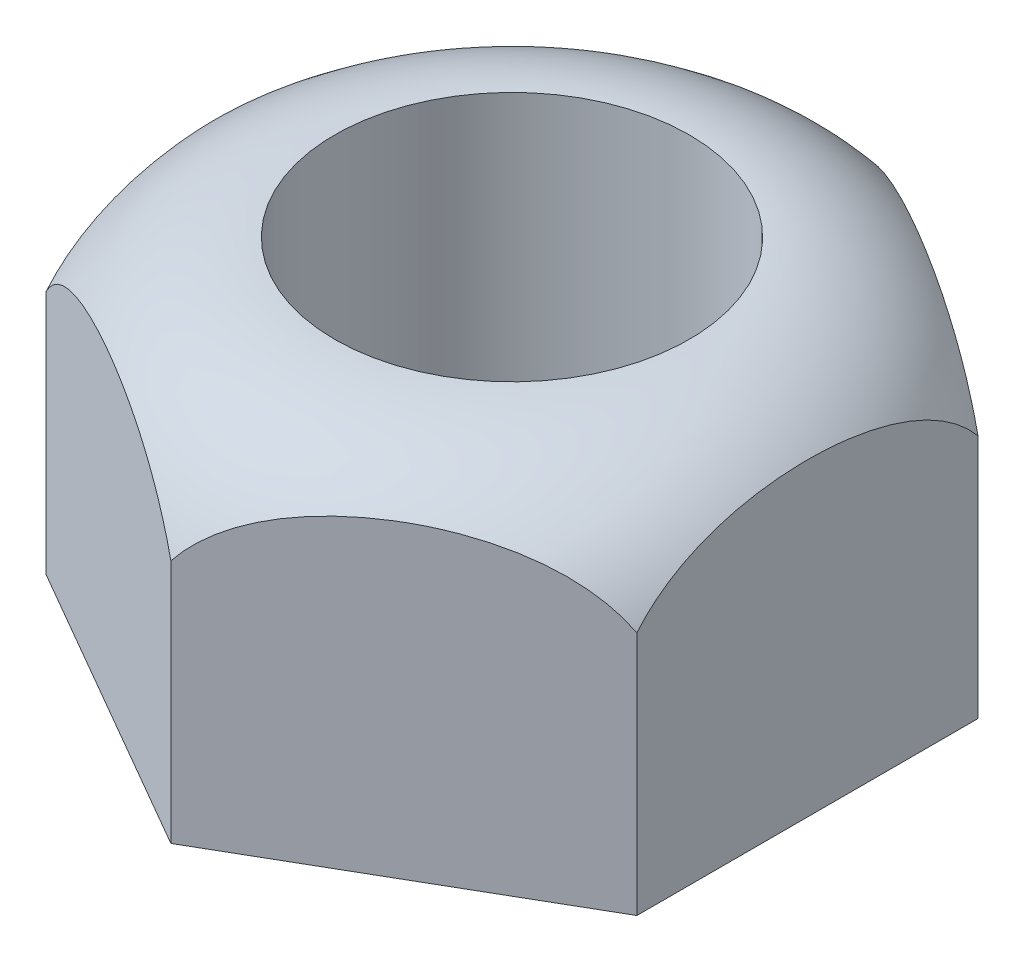
ISO-10303-21;
HEADER;
FILE_DESCRIPTION(('STEP AP214'),'2;1');
FILE_NAME('part.step','',(''),(''),'','','');
FILE_SCHEMA(('AUTOMOTIVE_DESIGN { 1 0 10303 214 1 1 1 1 }'));
ENDSEC;
DATA;
#1=APPLICATION_CONTEXT('core data for automotive mechanical design processes');
#2=APPLICATION_PROTOCOL_DEFINITION('international standard','automotive_design',2000,#1);
#3=PRODUCT_CONTEXT('',#1,'mechanical');
#4=PRODUCT('Part','Part','',(#3));
#5=PRODUCT_RELATED_PRODUCT_CATEGORY('part','',(#4));
#6=PRODUCT_DEFINITION_FORMATION('','',#4);
#7=PRODUCT_DEFINITION_CONTEXT('part definition',#1,'design');
#8=PRODUCT_DEFINITION('design','',#6,#7);
#9=PRODUCT_DEFINITION_SHAPE('','',#8);
#10=(LENGTH_UNIT() NAMED_UNIT(*) SI_UNIT(.MILLI.,.METRE.));
#11=(NAMED_UNIT(*) PLANE_ANGLE_UNIT() SI_UNIT($,.RADIAN.));
#12=(NAMED_UNIT(*) SI_UNIT($,.STERADIAN.) SOLID_ANGLE_UNIT());
#13=UNCERTAINTY_MEASURE_WITH_UNIT(LENGTH_MEASURE(1.E-05),#10,'distance_accuracy_value','');
#14=(GEOMETRIC_REPRESENTATION_CONTEXT(3) GLOBAL_UNCERTAINTY_ASSIGNED_CONTEXT((#13)) GLOBAL_UNIT_ASSIGNED_CONTEXT((#10,
#11,#12)) REPRESENTATION_CONTEXT('',''));
#15=CARTESIAN_POINT('',(0.,0.,0.));
#16=DIRECTION('',(0.,0.,1.));
#17=DIRECTION('',(1.,0.,0.));
#18=AXIS2_PLACEMENT_3D('',#15,#16,#17);
#19=CARTESIAN_POINT('',(0.,-3.,0.));
#20=DIRECTION('',(0.,1.,0.));
#21=DIRECTION('',(0.,0.,1.));
#22=AXIS2_PLACEMENT_3D('',#19,#20,#21);
#23=PLANE('',#22);
#24=DIRECTION('',(0.,0.,-1.));
#25=VECTOR('',#24,1.);
#26=CARTESIAN_POINT('',(4.99999999999999,-3.,2.88675134594813));
#27=LINE('',#26,#25);
#28=CARTESIAN_POINT('',(4.99999999999999,-3.,2.88675134594813));
#29=VERTEX_POINT('',#28);
#30=CARTESIAN_POINT('',(4.99999999999999,-3.,-2.88675134594813));
#31=VERTEX_POINT('',#30);
#32=EDGE_CURVE('E127',#29,#31,#27,.T.);
#33=ORIENTED_EDGE('',*,*,#32,.F.);
#34=DIRECTION('',(0.866025403784439,0.,-0.5));
#35=VECTOR('',#34,1.);
#36=CARTESIAN_POINT('',(0.,-3.,5.77350269189626));
#37=LINE('',#36,#35);
#38=CARTESIAN_POINT('',(0.,-3.,5.77350269189626));
#39=VERTEX_POINT('',#38);
#40=EDGE_CURVE('E116',#39,#29,#37,.T.);
#41=ORIENTED_EDGE('',*,*,#40,.F.);
#42=DIRECTION('',(0.866025403784439,0.,0.5));
#43=VECTOR('',#42,1.);
#44=CARTESIAN_POINT('',(-5.,-3.,2.88675134594813));
#45=LINE('',#44,#43);
#46=CARTESIAN_POINT('',(-5.,-3.,2.88675134594813));
#47=VERTEX_POINT('',#46);
#48=EDGE_CURVE('E118',#47,#39,#45,.T.);
#49=ORIENTED_EDGE('',*,*,#48,.F.);
#50=DIRECTION('',(0.,0.,1.));
#51=VECTOR('',#50,1.);
#52=CARTESIAN_POINT('',(-5.,-3.,-2.88675134594813));
#53=LINE('',#52,#51);
#54=CARTESIAN_POINT('',(-5.,-3.,-2.88675134594813));
#55=VERTEX_POINT('',#54);
#56=EDGE_CURVE('E121',#55,#47,#53,.T.);
#57=ORIENTED_EDGE('',*,*,#56,.F.);
#58=DIRECTION('',(-0.866025403784439,0.,0.5));
#59=VECTOR('',#58,1.);
#60=CARTESIAN_POINT('',(0.,-3.,-5.77350269189626));
#61=LINE('',#60,#59);
#62=CARTESIAN_POINT('',(0.,-3.,-5.77350269189626));
#63=VERTEX_POINT('',#62);
#64=EDGE_CURVE('E124',#63,#55,#61,.T.);
#65=ORIENTED_EDGE('',*,*,#64,.F.);
#66=DIRECTION('',(-0.866025403784439,0.,-0.5));
#67=VECTOR('',#66,1.);
#68=CARTESIAN_POINT('',(4.99999999999999,-3.,-2.88675134594813));
#69=LINE('',#68,#67);
#70=EDGE_CURVE('E107',#31,#63,#69,.T.);
#71=ORIENTED_EDGE('',*,*,#70,.F.);
#72=EDGE_LOOP('',(#33,#41,#49,#57,#65,#71));
#73=FACE_BOUND('',#72,.T.);
#74=CARTESIAN_POINT('',(0.,-3.,0.));
#75=DIRECTION('',(0.,1.,0.));
#76=DIRECTION('',(0.,0.,1.));
#77=AXIS2_PLACEMENT_3D('',#74,#75,#76);
#78=CIRCLE('',#77,3.);
#79=CARTESIAN_POINT('',(0.,-3.,3.));
#80=VERTEX_POINT('',#79);
#81=EDGE_CURVE('E129',#80,#80,#78,.T.);
#82=ORIENTED_EDGE('',*,*,#81,.T.);
#83=EDGE_LOOP('',(#82));
#84=FACE_BOUND('',#83,.T.);
#85=ADVANCED_FACE('F34',(#73,#84),#23,.F.);
#86=CARTESIAN_POINT('',(4.99999999999999,3.,2.88675134594813));
#87=DIRECTION('',(-1.,0.,0.));
#88=DIRECTION('',(0.,0.,1.));
#89=AXIS2_PLACEMENT_3D('',#86,#87,#88);
#90=PLANE('',#89);
#91=DIRECTION('',(0.,-1.,0.));
#92=VECTOR('',#91,1.);
#93=CARTESIAN_POINT('',(4.99999999999999,3.,-2.88675134594813));
#94=LINE('',#93,#92);
#95=CARTESIAN_POINT('',(5.,1.14353960055794,-2.88675134594813));
#96=VERTEX_POINT('',#95);
#97=EDGE_CURVE('E11',#96,#31,#94,.T.);
#98=ORIENTED_EDGE('',*,*,#97,.F.);
#99=CARTESIAN_POINT('',(4.99999999999999,2.23606797749979,0.));
#100=CARTESIAN_POINT('',(4.99999999999999,2.23606547708485,0.120918907635913));
#101=CARTESIAN_POINT('',(4.99999999999999,2.23215695883544,0.241827848779719));
#102=CARTESIAN_POINT('',(4.99999999999999,2.21636735639039,0.483117337858945));
#103=CARTESIAN_POINT('',(4.99999999999999,2.20448748147199,0.603497963153676));
#104=CARTESIAN_POINT('',(4.99999999999999,2.17230957672205,0.843175170668359));
#105=CARTESIAN_POINT('',(4.99999999999999,2.15200965486483,0.962471503081574));
#106=CARTESIAN_POINT('',(4.99999999999999,2.10228318635368,1.19911813128936));
#107=CARTESIAN_POINT('',(4.99999999999999,2.07285946731982,1.31646901815666));
#108=CARTESIAN_POINT('',(4.99999999999999,1.99149257912571,1.59010251201208));
#109=CARTESIAN_POINT('',(4.99999999999999,1.93525457949775,1.74515200180723));
#110=CARTESIAN_POINT('',(4.99999999999999,1.80136991737628,2.04572548254269));
#111=CARTESIAN_POINT('',(4.99999999999999,1.72375539118573,2.19126336952084));
#112=CARTESIAN_POINT('',(4.99999999999999,1.56277118376517,2.43890308689245));
#113=CARTESIAN_POINT('',(4.99999999999999,1.48377397538791,2.54382254430582));
#114=CARTESIAN_POINT('',(4.99999999999999,1.30987699827946,2.7396282799976));
#115=CARTESIAN_POINT('',(4.99999999999999,1.21499717596204,2.83053188858002));
#116=CARTESIAN_POINT('',(4.99999999999999,1.0301159573075,2.97723052563607));
#117=CARTESIAN_POINT('',(4.99999999999999,0.942813107119015,3.0364145149125));
#118=CARTESIAN_POINT('',(4.99999999999999,0.759583936212259,3.13957828549396));
#119=CARTESIAN_POINT('',(4.99999999999999,0.663661656029086,3.18356514439735));
#120=CARTESIAN_POINT('',(4.99999999999999,0.464847484174504,3.25393965352395));
#121=CARTESIAN_POINT('',(4.99999999999999,0.361917437478582,3.28022077701964));
#122=CARTESIAN_POINT('',(4.99999999999999,0.15294111182827,3.31290834387848));
#123=CARTESIAN_POINT('',(4.99999999999999,0.0468962069976227,3.31932342209303));
#124=CARTESIAN_POINT('',(4.99999999999999,-0.153734080318637,3.31222176535418));
#125=CARTESIAN_POINT('',(4.99999999999999,-0.248394487684605,3.30065386765089));
#126=CARTESIAN_POINT('',(4.99999999999999,-0.434404619303879,3.26181910522999));
#127=CARTESIAN_POINT('',(4.99999999999999,-0.525754653885907,3.23455371613119));
#128=CARTESIAN_POINT('',(4.99999999999999,-0.703233395942723,3.16568011577716));
#129=CARTESIAN_POINT('',(4.99999999999999,-0.789340379448156,3.12401645042847));
#130=CARTESIAN_POINT('',(4.99999999999999,-0.954375501924881,3.02836892053913));
#131=CARTESIAN_POINT('',(4.99999999999999,-1.03330025498121,2.97437928682587));
#132=CARTESIAN_POINT('',(4.99999999999999,-1.21217999234046,2.83319578618356));
#133=CARTESIAN_POINT('',(4.99999999999999,-1.30839251775865,2.74125094122274));
#134=CARTESIAN_POINT('',(4.99999999999999,-1.48457457681218,2.54296994059313));
#135=CARTESIAN_POINT('',(4.99999999999999,-1.5645150618035,2.43660860279747));
#136=CARTESIAN_POINT('',(4.99999999999999,-1.73831292997454,2.16830650460945));
#137=CARTESIAN_POINT('',(4.99999999999999,-1.82449575152687,2.0014223589474));
#138=CARTESIAN_POINT('',(4.99999999999999,-1.96979428306982,1.65626349949258));
#139=CARTESIAN_POINT('',(4.99999999999999,-2.0288469548393,1.47796334338487));
#140=CARTESIAN_POINT('',(4.99999999999999,-2.11230706123924,1.15914275681445));
#141=CARTESIAN_POINT('',(4.99999999999999,-2.14163215600666,1.01985771960752));
#142=CARTESIAN_POINT('',(4.99999999999999,-2.18827639288221,0.739223942062745));
#143=CARTESIAN_POINT('',(4.99999999999999,-2.20558839332926,0.597874025064965));
#144=CARTESIAN_POINT('',(4.99999999999999,-2.22908563764715,0.314037780514991));
#145=CARTESIAN_POINT('',(4.99999999999999,-2.2352521116048,0.171549941078096));
#146=CARTESIAN_POINT('',(4.99999999999999,-2.23673283017761,-0.113440619086964));
#147=CARTESIAN_POINT('',(4.99999999999999,-2.23205071801853,-0.255943318753454));
#148=CARTESIAN_POINT('',(4.99999999999999,-2.21317816931042,-0.518018786832451));
#149=CARTESIAN_POINT('',(4.99999999999999,-2.20058157063548,-0.637707348758131));
#150=CARTESIAN_POINT('',(4.99999999999999,-2.16699996802981,-0.875936112436773));
#151=CARTESIAN_POINT('',(4.99999999999999,-2.14601392442707,-0.994476169994405));
#152=CARTESIAN_POINT('',(4.99999999999999,-2.09500227924768,-1.22924960329497));
#153=CARTESIAN_POINT('',(4.99999999999999,-2.06500417832384,-1.34548886578246));
#154=CARTESIAN_POINT('',(4.99999999999999,-1.99503238840018,-1.57487815676775));
#155=CARTESIAN_POINT('',(4.99999999999999,-1.95506445754837,-1.68802992676516));
#156=CARTESIAN_POINT('',(4.99999999999999,-1.85282705434588,-1.93726711187123));
#157=CARTESIAN_POINT('',(4.99999999999999,-1.78748843719083,-2.07212579721777));
#158=CARTESIAN_POINT('',(4.99999999999999,-1.63755093552136,-2.3307739159673));
#159=CARTESIAN_POINT('',(4.99999999999999,-1.55297200147192,-2.45457463159287));
#160=CARTESIAN_POINT('',(4.99999999999999,-1.38203242292518,-2.66253632811602));
#161=CARTESIAN_POINT('',(4.99999999999999,-1.2993405858539,-2.7496924410226));
#162=CARTESIAN_POINT('',(4.99999999999999,-1.12084494282723,-2.909419315686));
#163=CARTESIAN_POINT('',(4.99999999999999,-1.02505637822909,-2.98200679289585));
#164=CARTESIAN_POINT('',(4.99999999999999,-0.838185476698753,-3.0982354091423));
#165=CARTESIAN_POINT('',(4.99999999999999,-0.748838484702114,-3.14465751090598));
#166=CARTESIAN_POINT('',(4.99999999999999,-0.563617831829161,-3.22195881654211));
#167=CARTESIAN_POINT('',(4.99999999999999,-0.467746985968321,-3.25284467656011));
#168=CARTESIAN_POINT('',(4.99999999999999,-0.271626556165446,-3.29731276667061));
#169=CARTESIAN_POINT('',(4.99999999999999,-0.171360951813679,-3.31082509659772));
#170=CARTESIAN_POINT('',(4.99999999999999,0.0299567601643019,-3.31940920815924));
#171=CARTESIAN_POINT('',(4.99999999999999,0.131008734859816,-3.31448404174156));
#172=CARTESIAN_POINT('',(4.99999999999999,0.323626511314792,-3.28751634425651));
#173=CARTESIAN_POINT('',(4.99999999999999,0.415365206264283,-3.26668052657209));
#174=CARTESIAN_POINT('',(4.99999999999999,0.594254757868503,-3.21051142143265));
#175=CARTESIAN_POINT('',(4.99999999999999,0.681405348220315,-3.17517729351067));
#176=CARTESIAN_POINT('',(4.99999999999999,0.852902766659784,-3.08996682861327));
#177=CARTESIAN_POINT('',(4.99999999999999,0.936971260358956,-3.0395342866492));
#178=CARTESIAN_POINT('',(4.99999999999999,1.09690441917607,-2.92708168680618));
#179=CARTESIAN_POINT('',(4.99999999999999,1.1727653643736,-2.86505640918113));
#180=CARTESIAN_POINT('',(4.99999999999999,1.34862628219194,-2.70091379330323));
#181=CARTESIAN_POINT('',(4.99999999999999,1.44367677918478,-2.59347912144342));
#182=CARTESIAN_POINT('',(4.99999999999999,1.61523047085954,-2.3646875635332));
#183=CARTESIAN_POINT('',(4.99999999999999,1.69168854122065,-2.2432978383347));
#184=CARTESIAN_POINT('',(4.99999999999999,1.85813802690555,-1.93419060871512));
#185=CARTESIAN_POINT('',(4.99999999999999,1.93857989311894,-1.74132926635834));
#186=CARTESIAN_POINT('',(4.99999999999999,2.03604362805079,-1.44490972333349));
#187=CARTESIAN_POINT('',(4.99999999999999,2.06468018171814,-1.3448228636016));
#188=CARTESIAN_POINT('',(4.99999999999999,2.11488760022331,-1.14288449210295));
#189=CARTESIAN_POINT('',(4.99999999999999,2.13645992156809,-1.04103334866254));
#190=CARTESIAN_POINT('',(4.99999999999999,2.18243116291176,-0.783859414389841));
#191=CARTESIAN_POINT('',(4.99999999999999,2.20264847587348,-0.627789688123208));
#192=CARTESIAN_POINT('',(4.99999999999999,2.22947043045928,-0.314474570572886));
#193=CARTESIAN_POINT('',(4.99999999999999,2.23607122874808,-0.157228859927116));
#194=CARTESIAN_POINT('',(4.99999999999999,2.23606797749979,0.));
#195=B_SPLINE_CURVE_WITH_KNOTS('',3,(#99,#100,#101,#102,#103,#104,#105,#106,#107,#108,#109,#110,
#111,#112,#113,#114,#115,#116,#117,#118,#119,#120,#121,#122,#123,#124,#125,#126,#127,#128,#129,
#130,#131,#132,#133,#134,#135,#136,#137,#138,#139,#140,#141,#142,#143,#144,#145,#146,#147,#148,
#149,#150,#151,#152,#153,#154,#155,#156,#157,#158,#159,#160,#161,#162,#163,#164,#165,#166,#167,
#168,#169,#170,#171,#172,#173,#174,#175,#176,#177,#178,#179,#180,#181,#182,#183,#184,#185,#186,
#187,#188,#189,#190,#191,#192,#193,#194),.UNSPECIFIED.,.T.,.F.,(4,2,2,2,2,2,2,2,2,2,2,2,2,2,2,2,
2,2,2,2,2,2,2,2,2,2,2,2,2,2,2,2,2,2,2,2,2,2,2,2,2,2,2,2,2,2,2,4),(0.,0.362673965901397,
0.72529292557616,1.08799341168277,1.45058160289177,1.94401806167096,2.43671672640692,
2.82932144264359,3.22143674955952,3.53657847104138,3.8515732264426,4.16844661865274,
4.48518226130435,4.76990781469742,5.05460660726683,5.34041435089636,5.6263561421647,
6.02338925123516,6.42112504006141,6.98148877350558,7.54314803489807,7.96962891026468,
8.39636310741747,8.8238152901349,9.25112394455638,9.611905094895,9.97273096933659,
10.3324667643941,10.6919952705368,11.1401969679133,11.5879360221887,11.9470202530772,
12.3056901001392,12.6064755350347,12.9071319953369,13.2089943614697,13.5108067627123,
13.791757368672,14.072724263638,14.3656805716756,14.6587691054092,15.0866864035578,
15.5156321286721,16.1388153709031,16.4509640992346,16.7630484280037,17.2344943502383,
17.7060733224502),.UNSPECIFIED.);
#196=CARTESIAN_POINT('',(5.,1.14353960055794,2.88675134594813));
#197=VERTEX_POINT('',#196);
#198=EDGE_CURVE('E92',#96,#197,#195,.T.);
#199=ORIENTED_EDGE('',*,*,#198,.T.);
#200=DIRECTION('',(0.,-1.,0.));
#201=VECTOR('',#200,1.);
#202=CARTESIAN_POINT('',(4.99999999999999,3.,2.88675134594813));
#203=LINE('',#202,#201);
#204=EDGE_CURVE('E58',#197,#29,#203,.T.);
#205=ORIENTED_EDGE('',*,*,#204,.T.);
#206=ORIENTED_EDGE('',*,*,#32,.T.);
#207=EDGE_LOOP('',(#98,#199,#205,#206));
#208=FACE_BOUND('',#207,.T.);
#209=ADVANCED_FACE('F36',(#208),#90,.F.);
#210=CARTESIAN_POINT('',(4.99999999999999,3.,-2.88675134594813));
#211=DIRECTION('',(-0.5,0.,0.866025403784439));
#212=DIRECTION('',(0.866025403784439,0.,0.5));
#213=AXIS2_PLACEMENT_3D('',#210,#211,#212);
#214=PLANE('',#213);
#215=DIRECTION('',(0.,-1.,0.));
#216=VECTOR('',#215,1.);
#217=CARTESIAN_POINT('',(0.,3.,-5.77350269189626));
#218=LINE('',#217,#216);
#219=CARTESIAN_POINT('',(0.,1.14353960055794,-5.77350269189626));
#220=VERTEX_POINT('',#219);
#221=EDGE_CURVE('E43',#220,#63,#218,.T.);
#222=ORIENTED_EDGE('',*,*,#221,.F.);
#223=CARTESIAN_POINT('',(-0.000142810290228146,1.14333960055794,-5.77358514345576));
#224=CARTESIAN_POINT('',(0.0893124367608543,1.26853746801625,-5.72193813249039));
#225=CARTESIAN_POINT('',(0.190281036219496,1.38106208917785,-5.66364388441325));
#226=CARTESIAN_POINT('',(0.407192690678229,1.58081776284459,-5.53840988232113));
#227=CARTESIAN_POINT('',(0.522887072573814,1.66840452885689,-5.47161369978999));
#228=CARTESIAN_POINT('',(0.800973119005675,1.8453618653456,-5.31106064602468));
#229=CARTESIAN_POINT('',(0.966868613847032,1.92718000731215,-5.21528083742067));
#230=CARTESIAN_POINT('',(1.30867200266892,2.06044665989698,-5.01794055887443));
#231=CARTESIAN_POINT('',(1.48464915509275,2.11164793833912,-4.91634010255131));
#232=CARTESIAN_POINT('',(1.79145018682874,2.17711091081525,-4.73920844429088));
#233=CARTESIAN_POINT('',(1.92132792676049,2.19766815653355,-4.66422349617955));
#234=CARTESIAN_POINT('',(2.18219334190964,2.22609275762975,-4.51361277852092));
#235=CARTESIAN_POINT('',(2.31318159389259,2.23395305381997,-4.43798667597788));
#236=CARTESIAN_POINT('',(2.57506109966329,2.23743805351204,-4.28679047282592));
#237=CARTESIAN_POINT('',(2.70595216180202,2.23308274414345,-4.21122048286561));
#238=CARTESIAN_POINT('',(2.96690448797829,2.21191397733964,-4.06055958710208));
#239=CARTESIAN_POINT('',(3.09696617716107,2.19510752531275,-3.98546843584115));
#240=CARTESIAN_POINT('',(3.40008780053761,2.13995147605242,-3.8104610849875));
#241=CARTESIAN_POINT('',(3.57244496899929,2.09615790937785,-3.71095062737939));
#242=CARTESIAN_POINT('',(3.9098954373457,1.98015119492548,-3.51612350864143));
#243=CARTESIAN_POINT('',(4.07500016298977,1.90798467322086,-3.42080025084634));
#244=CARTESIAN_POINT('',(4.34810663584005,1.75430816427858,-3.2631221552288));
#245=CARTESIAN_POINT('',(4.45941552985277,1.68069324538259,-3.19885793530736));
#246=CARTESIAN_POINT('',(4.6702948231368,1.51399060964207,-3.07710671856331));
#247=CARTESIAN_POINT('',(4.7699080013148,1.42097754781097,-3.01959502332741));
#248=CARTESIAN_POINT('',(4.90999536744939,1.26268968281893,-2.93871554477953));
#249=CARTESIAN_POINT('',(4.95652867353715,1.20445511317756,-2.91184952798348));
#250=CARTESIAN_POINT('',(5.00014281029023,1.14333960055794,-2.88666889438862));
#251=B_SPLINE_CURVE_WITH_KNOTS('',3,(#223,#224,#225,#226,#227,#228,#229,#230,#231,#232,#233,
#234,#235,#236,#237,#238,#239,#240,#241,#242,#243,#244,#245,#246,#247,#248,#249,#250),
.UNSPECIFIED.,.F.,.F.,(4,2,2,2,2,2,2,2,2,2,2,2,2,4),(0.,0.483993268461521,0.960690674025162,
1.58230674436584,2.20887687993225,2.66247501095778,3.1163252445534,3.56943332344352,
4.02228666275751,4.63192059230963,5.24055685286809,5.68346282766207,6.12469470637231,
6.36206056069102),.UNSPECIFIED.);
#252=EDGE_CURVE('E87',#220,#96,#251,.T.);
#253=ORIENTED_EDGE('',*,*,#252,.T.);
#254=ORIENTED_EDGE('',*,*,#97,.T.);
#255=ORIENTED_EDGE('',*,*,#70,.T.);
#256=EDGE_LOOP('',(#222,#253,#254,#255));
#257=FACE_BOUND('',#256,.T.);
#258=ADVANCED_FACE('F105',(#257),#214,.F.);
#259=CARTESIAN_POINT('',(0.,3.,-5.77350269189626));
#260=DIRECTION('',(0.5,0.,0.866025403784438));
#261=DIRECTION('',(0.866025403784439,0.,-0.5));
#262=AXIS2_PLACEMENT_3D('',#259,#260,#261);
#263=PLANE('',#262);
#264=DIRECTION('',(0.,-1.,0.));
#265=VECTOR('',#264,1.);
#266=CARTESIAN_POINT('',(-5.,3.,-2.88675134594813));
#267=LINE('',#266,#265);
#268=CARTESIAN_POINT('',(-5.,1.14353960055794,-2.88675134594813));
#269=VERTEX_POINT('',#268);
#270=EDGE_CURVE('E102',#269,#55,#267,.T.);
#271=ORIENTED_EDGE('',*,*,#270,.F.);
#272=CARTESIAN_POINT('',(-5.00014281029022,1.14333960055794,-2.88666889438863));
#273=CARTESIAN_POINT('',(-4.91068756323914,1.26853746801625,-2.93831590535399));
#274=CARTESIAN_POINT('',(-4.8097189637805,1.38106208917785,-2.99661015343114));
#275=CARTESIAN_POINT('',(-4.59280730932177,1.58081776284459,-3.12184415552326));
#276=CARTESIAN_POINT('',(-4.47711292742618,1.66840452885689,-3.1886403380544));
#277=CARTESIAN_POINT('',(-4.19902688099432,1.8453618653456,-3.34919339181971));
#278=CARTESIAN_POINT('',(-4.03313138615296,1.92718000731214,-3.44497320042372));
#279=CARTESIAN_POINT('',(-3.69132799733107,2.06044665989698,-3.64231347896996));
#280=CARTESIAN_POINT('',(-3.51535084490724,2.11164793833912,-3.74391393529309));
#281=CARTESIAN_POINT('',(-3.20854981317126,2.17711091081525,-3.92104559355351));
#282=CARTESIAN_POINT('',(-3.07867207323951,2.19766815653355,-3.99603054166485));
#283=CARTESIAN_POINT('',(-2.81780665809036,2.22609275762975,-4.14664125932347));
#284=CARTESIAN_POINT('',(-2.68681840610741,2.23395305381997,-4.22226736186651));
#285=CARTESIAN_POINT('',(-2.42493890033671,2.23743805351204,-4.37346356501847));
#286=CARTESIAN_POINT('',(-2.29404783819798,2.23308274414345,-4.44903355497878));
#287=CARTESIAN_POINT('',(-2.03309551202171,2.21191397733964,-4.59969445074231));
#288=CARTESIAN_POINT('',(-1.90303382283893,2.19510752531275,-4.67478560200324));
#289=CARTESIAN_POINT('',(-1.59991219946238,2.13995147605242,-4.84979295285689));
#290=CARTESIAN_POINT('',(-1.4275550310007,2.09615790937785,-4.949303410465));
#291=CARTESIAN_POINT('',(-1.0901045626543,1.98015119492548,-5.14413052920296));
#292=CARTESIAN_POINT('',(-0.924999837010228,1.90798467322086,-5.23945378699805));
#293=CARTESIAN_POINT('',(-0.651893364159947,1.75430816427858,-5.39713188261558));
#294=CARTESIAN_POINT('',(-0.540584470147226,1.68069324538258,-5.46139610253703));
#295=CARTESIAN_POINT('',(-0.329705176863198,1.51399060964207,-5.58314731928108));
#296=CARTESIAN_POINT('',(-0.230091998685199,1.42097754781097,-5.64065901451698));
#297=CARTESIAN_POINT('',(-0.0900046325506105,1.26268968281893,-5.72153849306485));
#298=CARTESIAN_POINT('',(-0.0434713264628498,1.20445511317756,-5.7484045098609));
#299=CARTESIAN_POINT('',(0.000142810290220696,1.14333960055794,-5.77358514345576));
#300=B_SPLINE_CURVE_WITH_KNOTS('',3,(#272,#273,#274,#275,#276,#277,#278,#279,#280,#281,#282,
#283,#284,#285,#286,#287,#288,#289,#290,#291,#292,#293,#294,#295,#296,#297,#298,#299),
.UNSPECIFIED.,.F.,.F.,(4,2,2,2,2,2,2,2,2,2,2,2,2,4),(0.,0.48399326846152,0.960690674025162,
1.58230674436584,2.20887687993225,2.66247501095778,3.1163252445534,3.56943332344352,
4.02228666275751,4.63192059230963,5.24055685286808,5.68346282766206,6.1246947063723,
6.36206056069101),.UNSPECIFIED.);
#301=EDGE_CURVE('E90',#269,#220,#300,.T.);
#302=ORIENTED_EDGE('',*,*,#301,.T.);
#303=ORIENTED_EDGE('',*,*,#221,.T.);
#304=ORIENTED_EDGE('',*,*,#64,.T.);
#305=EDGE_LOOP('',(#271,#302,#303,#304));
#306=FACE_BOUND('',#305,.T.);
#307=ADVANCED_FACE('F99',(#306),#263,.F.);
#308=CARTESIAN_POINT('',(-5.,3.,-2.88675134594813));
#309=DIRECTION('',(1.,0.,0.));
#310=DIRECTION('',(0.,0.,-1.));
#311=AXIS2_PLACEMENT_3D('',#308,#309,#310);
#312=PLANE('',#311);
#313=DIRECTION('',(0.,-1.,0.));
#314=VECTOR('',#313,1.);
#315=CARTESIAN_POINT('',(-5.,3.,2.88675134594813));
#316=LINE('',#315,#314);
#317=CARTESIAN_POINT('',(-5.,1.14353960055794,2.88675134594813));
#318=VERTEX_POINT('',#317);
#319=EDGE_CURVE('E109',#318,#47,#316,.T.);
#320=ORIENTED_EDGE('',*,*,#319,.F.);
#321=CARTESIAN_POINT('',(-5.,2.23606797749979,0.));
#322=CARTESIAN_POINT('',(-5.,2.23606547708484,-0.120918907635912));
#323=CARTESIAN_POINT('',(-5.,2.23215695883543,-0.241827848779718));
#324=CARTESIAN_POINT('',(-5.,2.21636735639038,-0.483117337858945));
#325=CARTESIAN_POINT('',(-5.,2.20448748147198,-0.603497963153676));
#326=CARTESIAN_POINT('',(-5.,2.17230957672204,-0.84317517066836));
#327=CARTESIAN_POINT('',(-5.,2.15200965486482,-0.962471503081576));
#328=CARTESIAN_POINT('',(-5.,2.10228318635367,-1.19911813128937));
#329=CARTESIAN_POINT('',(-5.,2.07285946731981,-1.31646901815666));
#330=CARTESIAN_POINT('',(-5.,1.9914925791257,-1.59010251201208));
#331=CARTESIAN_POINT('',(-5.,1.93525457949774,-1.74515200180724));
#332=CARTESIAN_POINT('',(-5.,1.80136991737627,-2.04572548254269));
#333=CARTESIAN_POINT('',(-5.,1.72375539118572,-2.19126336952084));
#334=CARTESIAN_POINT('',(-5.,1.56277118376516,-2.43890308689245));
#335=CARTESIAN_POINT('',(-5.,1.4837739753879,-2.54382254430581));
#336=CARTESIAN_POINT('',(-5.,1.30987699827945,-2.73962827999759));
#337=CARTESIAN_POINT('',(-5.,1.21499717596203,-2.83053188858002));
#338=CARTESIAN_POINT('',(-5.,1.0301159573075,-2.97723052563607));
#339=CARTESIAN_POINT('',(-5.,0.942813107119006,-3.03641451491249));
#340=CARTESIAN_POINT('',(-5.,0.75958393621225,-3.13957828549395));
#341=CARTESIAN_POINT('',(-5.,0.663661656029078,-3.18356514439734));
#342=CARTESIAN_POINT('',(-5.,0.464847484174497,-3.25393965352394));
#343=CARTESIAN_POINT('',(-5.,0.361917437478576,-3.28022077701963));
#344=CARTESIAN_POINT('',(-5.,0.152941111828265,-3.31290834387847));
#345=CARTESIAN_POINT('',(-5.,0.0468962069976182,-3.31932342209301));
#346=CARTESIAN_POINT('',(-5.,-0.153734080318641,-3.31222176535417));
#347=CARTESIAN_POINT('',(-5.,-0.248394487684607,-3.30065386765088));
#348=CARTESIAN_POINT('',(-5.,-0.43440461930388,-3.26181910522997));
#349=CARTESIAN_POINT('',(-5.,-0.525754653885909,-3.23455371613117));
#350=CARTESIAN_POINT('',(-5.,-0.703233395942724,-3.16568011577715));
#351=CARTESIAN_POINT('',(-5.,-0.789340379448155,-3.12401645042845));
#352=CARTESIAN_POINT('',(-5.,-0.95437550192488,-3.02836892053912));
#353=CARTESIAN_POINT('',(-5.,-1.03330025498121,-2.97437928682585));
#354=CARTESIAN_POINT('',(-5.,-1.21217999234046,-2.83319578618354));
#355=CARTESIAN_POINT('',(-5.,-1.30839251775865,-2.74125094122272));
#356=CARTESIAN_POINT('',(-5.,-1.48457457681218,-2.54296994059312));
#357=CARTESIAN_POINT('',(-5.,-1.56451506180349,-2.43660860279746));
#358=CARTESIAN_POINT('',(-5.,-1.73831292997453,-2.16830650460943));
#359=CARTESIAN_POINT('',(-5.,-1.82449575152686,-2.00142235894739));
#360=CARTESIAN_POINT('',(-5.,-1.96979428306981,-1.65626349949257));
#361=CARTESIAN_POINT('',(-5.,-2.0288469548393,-1.47796334338485));
#362=CARTESIAN_POINT('',(-5.,-2.11230706123924,-1.15914275681443));
#363=CARTESIAN_POINT('',(-5.,-2.14163215600665,-1.01985771960751));
#364=CARTESIAN_POINT('',(-5.,-2.1882763928822,-0.739223942062733));
#365=CARTESIAN_POINT('',(-5.,-2.20558839332925,-0.597874025064953));
#366=CARTESIAN_POINT('',(-5.,-2.22908563764714,-0.31403778051498));
#367=CARTESIAN_POINT('',(-5.,-2.2352521116048,-0.171549941078086));
#368=CARTESIAN_POINT('',(-5.,-2.23673283017761,0.113440619086973));
#369=CARTESIAN_POINT('',(-5.,-2.23205071801852,0.255943318753463));
#370=CARTESIAN_POINT('',(-5.,-2.21317816931041,0.518018786832457));
#371=CARTESIAN_POINT('',(-5.,-2.20058157063547,0.637707348758135));
#372=CARTESIAN_POINT('',(-5.,-2.1669999680298,0.875936112436775));
#373=CARTESIAN_POINT('',(-5.,-2.14601392442707,0.994476169994407));
#374=CARTESIAN_POINT('',(-5.,-2.09500227924767,1.22924960329497));
#375=CARTESIAN_POINT('',(-5.,-2.06500417832383,1.34548886578246));
#376=CARTESIAN_POINT('',(-5.,-1.99503238840017,1.57487815676774));
#377=CARTESIAN_POINT('',(-5.,-1.95506445754836,1.68802992676515));
#378=CARTESIAN_POINT('',(-5.,-1.85282705434587,1.93726711187123));
#379=CARTESIAN_POINT('',(-5.,-1.78748843719082,2.07212579721776));
#380=CARTESIAN_POINT('',(-5.,-1.63755093552136,2.33077391596729));
#381=CARTESIAN_POINT('',(-5.,-1.55297200147191,2.45457463159286));
#382=CARTESIAN_POINT('',(-5.,-1.38203242292517,2.66253632811601));
#383=CARTESIAN_POINT('',(-5.,-1.29934058585389,2.74969244102259));
#384=CARTESIAN_POINT('',(-5.,-1.12084494282722,2.90941931568599));
#385=CARTESIAN_POINT('',(-5.,-1.02505637822909,2.98200679289584));
#386=CARTESIAN_POINT('',(-5.,-0.838185476698747,3.09823540914229));
#387=CARTESIAN_POINT('',(-5.,-0.748838484702108,3.14465751090597));
#388=CARTESIAN_POINT('',(-5.,-0.563617831829155,3.22195881654209));
#389=CARTESIAN_POINT('',(-5.,-0.467746985968316,3.2528446765601));
#390=CARTESIAN_POINT('',(-5.,-0.271626556165443,3.2973127666706));
#391=CARTESIAN_POINT('',(-5.,-0.171360951813676,3.31082509659771));
#392=CARTESIAN_POINT('',(-5.,0.0299567601643046,3.31940920815922));
#393=CARTESIAN_POINT('',(-5.,0.131008734859818,3.31448404174155));
#394=CARTESIAN_POINT('',(-5.,0.323626511314793,3.28751634425649));
#395=CARTESIAN_POINT('',(-5.,0.415365206264284,3.26668052657207));
#396=CARTESIAN_POINT('',(-5.,0.594254757868503,3.21051142143263));
#397=CARTESIAN_POINT('',(-5.,0.681405348220314,3.17517729351065));
#398=CARTESIAN_POINT('',(-5.,0.852902766659783,3.08996682861325));
#399=CARTESIAN_POINT('',(-5.,0.936971260358954,3.03953428664919));
#400=CARTESIAN_POINT('',(-5.,1.09690441917607,2.92708168680616));
#401=CARTESIAN_POINT('',(-5.,1.1727653643736,2.86505640918111));
#402=CARTESIAN_POINT('',(-5.,1.34862628219193,2.70091379330321));
#403=CARTESIAN_POINT('',(-5.,1.44367677918477,2.5934791214434));
#404=CARTESIAN_POINT('',(-5.,1.61523047085954,2.36468756353319));
#405=CARTESIAN_POINT('',(-5.,1.69168854122064,2.24329783833468));
#406=CARTESIAN_POINT('',(-5.,1.85813802690555,1.93419060871511));
#407=CARTESIAN_POINT('',(-5.00000000000001,1.93857989311893,1.74132926635832));
#408=CARTESIAN_POINT('',(-5.,2.03604362805078,1.44490972333348));
#409=CARTESIAN_POINT('',(-5.,2.06468018171813,1.34482286360159));
#410=CARTESIAN_POINT('',(-5.,2.1148876002233,1.14288449210294));
#411=CARTESIAN_POINT('',(-5.,2.13645992156808,1.04103334866253));
#412=CARTESIAN_POINT('',(-5.,2.18243116291176,0.783859414389831));
#413=CARTESIAN_POINT('',(-5.,2.20264847587347,0.627789688123201));
#414=CARTESIAN_POINT('',(-5.,2.22947043045927,0.314474570572883));
#415=CARTESIAN_POINT('',(-5.,2.23607122874807,0.157228859927116));
#416=CARTESIAN_POINT('',(-5.,2.23606797749979,0.));
#417=B_SPLINE_CURVE_WITH_KNOTS('',3,(#321,#322,#323,#324,#325,#326,#327,#328,#329,#330,#331,
#332,#333,#334,#335,#336,#337,#338,#339,#340,#341,#342,#343,#344,#345,#346,#347,#348,#349,#350,
#351,#352,#353,#354,#355,#356,#357,#358,#359,#360,#361,#362,#363,#364,#365,#366,#367,#368,#369,
#370,#371,#372,#373,#374,#375,#376,#377,#378,#379,#380,#381,#382,#383,#384,#385,#386,#387,#388,
#389,#390,#391,#392,#393,#394,#395,#396,#397,#398,#399,#400,#401,#402,#403,#404,#405,#406,#407,
#408,#409,#410,#411,#412,#413,#414,#415,#416),.UNSPECIFIED.,.T.,.F.,(4,2,2,2,2,2,2,2,2,2,2,2,2,
2,2,2,2,2,2,2,2,2,2,2,2,2,2,2,2,2,2,2,2,2,2,2,2,2,2,2,2,2,2,2,2,2,2,4),(0.,0.362673965901398,
0.725292925576163,1.08799341168277,1.45058160289177,1.94401806167097,2.43671672640692,
2.82932144264359,3.22143674955951,3.53657847104137,3.8515732264426,4.16844661865273,
4.48518226130434,4.7699078146974,5.05460660726682,5.34041435089634,5.62635614216469,
6.02338925123514,6.4211250400614,6.98148877350556,7.54314803489805,7.96962891026466,
8.39636310741745,8.82381529013488,9.25112394455636,9.61190509489497,9.97273096933656,
10.332466764394,10.6919952705367,11.1401969679133,11.5879360221887,11.9470202530772,
12.3056901001392,12.6064755350347,12.9071319953368,13.2089943614696,13.5108067627122,
13.7917573686719,14.072724263638,14.3656805716756,14.6587691054091,15.0866864035577,
15.515632128672,16.1388153709031,16.4509640992346,16.7630484280036,17.2344943502383,
17.7060733224501),.UNSPECIFIED.);
#418=EDGE_CURVE('E103',#318,#269,#417,.T.);
#419=ORIENTED_EDGE('',*,*,#418,.T.);
#420=ORIENTED_EDGE('',*,*,#270,.T.);
#421=ORIENTED_EDGE('',*,*,#56,.T.);
#422=EDGE_LOOP('',(#320,#419,#420,#421));
#423=FACE_BOUND('',#422,.T.);
#424=ADVANCED_FACE('F177',(#423),#312,.F.);
#425=CARTESIAN_POINT('',(-5.,3.,2.88675134594813));
#426=DIRECTION('',(0.5,0.,-0.866025403784439));
#427=DIRECTION('',(-0.866025403784439,0.,-0.5));
#428=AXIS2_PLACEMENT_3D('',#425,#426,#427);
#429=PLANE('',#428);
#430=DIRECTION('',(0.,-1.,0.));
#431=VECTOR('',#430,1.);
#432=CARTESIAN_POINT('',(0.,3.,5.77350269189626));
#433=LINE('',#432,#431);
#434=CARTESIAN_POINT('',(0.,1.14353960055794,5.77350269189626));
#435=VERTEX_POINT('',#434);
#436=EDGE_CURVE('E113',#435,#39,#433,.T.);
#437=ORIENTED_EDGE('',*,*,#436,.F.);
#438=CARTESIAN_POINT('',(0.000142810290220453,1.14333960055794,5.77358514345576));
#439=CARTESIAN_POINT('',(-0.0893124367608628,1.26853746801625,5.7219381324904));
#440=CARTESIAN_POINT('',(-0.190281036219505,1.38106208917785,5.66364388441325));
#441=CARTESIAN_POINT('',(-0.407192690678238,1.58081776284459,5.53840988232113));
#442=CARTESIAN_POINT('',(-0.522887072573822,1.66840452885689,5.47161369978999));
#443=CARTESIAN_POINT('',(-0.800973119005683,1.8453618653456,5.31106064602468));
#444=CARTESIAN_POINT('',(-0.966868613847041,1.92718000731215,5.21528083742067));
#445=CARTESIAN_POINT('',(-1.30867200266893,2.06044665989698,5.01794055887443));
#446=CARTESIAN_POINT('',(-1.48464915509276,2.11164793833912,4.9163401025513));
#447=CARTESIAN_POINT('',(-1.79145018682875,2.17711091081525,4.73920844429088));
#448=CARTESIAN_POINT('',(-1.9213279267605,2.19766815653355,4.66422349617954));
#449=CARTESIAN_POINT('',(-2.18219334190965,2.22609275762975,4.51361277852092));
#450=CARTESIAN_POINT('',(-2.3131815938926,2.23395305381997,4.43798667597788));
#451=CARTESIAN_POINT('',(-2.5750610996633,2.23743805351204,4.28679047282592));
#452=CARTESIAN_POINT('',(-2.70595216180203,2.23308274414345,4.21122048286561));
#453=CARTESIAN_POINT('',(-2.9669044879783,2.21191397733964,4.06055958710208));
#454=CARTESIAN_POINT('',(-3.09696617716108,2.19510752531274,3.98546843584115));
#455=CARTESIAN_POINT('',(-3.40008780053762,2.13995147605242,3.8104610849875));
#456=CARTESIAN_POINT('',(-3.5724449689993,2.09615790937785,3.71095062737939));
#457=CARTESIAN_POINT('',(-3.9098954373457,1.98015119492547,3.51612350864143));
#458=CARTESIAN_POINT('',(-4.07500016298978,1.90798467322085,3.42080025084634));
#459=CARTESIAN_POINT('',(-4.34810663584006,1.75430816427858,3.26312215522881));
#460=CARTESIAN_POINT('',(-4.45941552985278,1.68069324538258,3.19885793530736));
#461=CARTESIAN_POINT('',(-4.6702948231368,1.51399060964207,3.07710671856331));
#462=CARTESIAN_POINT('',(-4.7699080013148,1.42097754781096,3.01959502332741));
#463=CARTESIAN_POINT('',(-4.90999536744939,1.26268968281893,2.93871554477954));
#464=CARTESIAN_POINT('',(-4.95652867353715,1.20445511317756,2.91184952798349));
#465=CARTESIAN_POINT('',(-5.00014281029022,1.14333960055794,2.88666889438863));
#466=B_SPLINE_CURVE_WITH_KNOTS('',3,(#438,#439,#440,#441,#442,#443,#444,#445,#446,#447,#448,
#449,#450,#451,#452,#453,#454,#455,#456,#457,#458,#459,#460,#461,#462,#463,#464,#465),
.UNSPECIFIED.,.F.,.F.,(4,2,2,2,2,2,2,2,2,2,2,2,2,4),(0.,0.483993268461521,0.960690674025162,
1.58230674436584,2.20887687993225,2.66247501095778,3.1163252445534,3.56943332344352,
4.02228666275751,4.63192059230963,5.24055685286808,5.68346282766206,6.1246947063723,
6.362060560691),.UNSPECIFIED.);
#467=EDGE_CURVE('E50',#435,#318,#466,.T.);
#468=ORIENTED_EDGE('',*,*,#467,.T.);
#469=ORIENTED_EDGE('',*,*,#319,.T.);
#470=ORIENTED_EDGE('',*,*,#48,.T.);
#471=EDGE_LOOP('',(#437,#468,#469,#470));
#472=FACE_BOUND('',#471,.T.);
#473=ADVANCED_FACE('F193',(#472),#429,.F.);
#474=CARTESIAN_POINT('',(0.,3.,5.77350269189626));
#475=DIRECTION('',(-0.5,0.,-0.866025403784439));
#476=DIRECTION('',(-0.866025403784439,0.,0.5));
#477=AXIS2_PLACEMENT_3D('',#474,#475,#476);
#478=PLANE('',#477);
#479=ORIENTED_EDGE('',*,*,#204,.F.);
#480=CARTESIAN_POINT('',(5.00014281029022,1.14333960055794,2.88666889438863));
#481=CARTESIAN_POINT('',(4.91068756323914,1.26853746801625,2.93831590535399));
#482=CARTESIAN_POINT('',(4.8097189637805,1.38106208917785,2.99661015343114));
#483=CARTESIAN_POINT('',(4.59280730932177,1.58081776284459,3.12184415552326));
#484=CARTESIAN_POINT('',(4.47711292742618,1.66840452885689,3.1886403380544));
#485=CARTESIAN_POINT('',(4.19902688099432,1.8453618653456,3.34919339181971));
#486=CARTESIAN_POINT('',(4.03313138615296,1.92718000731214,3.44497320042372));
#487=CARTESIAN_POINT('',(3.69132799733108,2.06044665989698,3.64231347896996));
#488=CARTESIAN_POINT('',(3.51535084490724,2.11164793833912,3.74391393529308));
#489=CARTESIAN_POINT('',(3.20854981317126,2.17711091081525,3.92104559355351));
#490=CARTESIAN_POINT('',(3.07867207323951,2.19766815653355,3.99603054166485));
#491=CARTESIAN_POINT('',(2.81780665809036,2.22609275762975,4.14664125932347));
#492=CARTESIAN_POINT('',(2.68681840610741,2.23395305381997,4.22226736186651));
#493=CARTESIAN_POINT('',(2.42493890033671,2.23743805351204,4.37346356501847));
#494=CARTESIAN_POINT('',(2.29404783819798,2.23308274414345,4.44903355497878));
#495=CARTESIAN_POINT('',(2.03309551202171,2.21191397733964,4.59969445074231));
#496=CARTESIAN_POINT('',(1.90303382283892,2.19510752531275,4.67478560200324));
#497=CARTESIAN_POINT('',(1.59991219946238,2.13995147605242,4.84979295285689));
#498=CARTESIAN_POINT('',(1.4275550310007,2.09615790937785,4.949303410465));
#499=CARTESIAN_POINT('',(1.0901045626543,1.98015119492548,5.14413052920296));
#500=CARTESIAN_POINT('',(0.924999837010223,1.90798467322086,5.23945378699804));
#501=CARTESIAN_POINT('',(0.651893364159942,1.75430816427858,5.39713188261558));
#502=CARTESIAN_POINT('',(0.540584470147222,1.68069324538259,5.46139610253703));
#503=CARTESIAN_POINT('',(0.329705176863194,1.51399060964207,5.58314731928108));
#504=CARTESIAN_POINT('',(0.230091998685194,1.42097754781097,5.64065901451698));
#505=CARTESIAN_POINT('',(0.0900046325506047,1.26268968281893,5.72153849306485));
#506=CARTESIAN_POINT('',(0.0434713264628437,1.20445511317756,5.7484045098609));
#507=CARTESIAN_POINT('',(-0.000142810290227179,1.14333960055794,5.77358514345576));
#508=B_SPLINE_CURVE_WITH_KNOTS('',3,(#480,#481,#482,#483,#484,#485,#486,#487,#488,#489,#490,
#491,#492,#493,#494,#495,#496,#497,#498,#499,#500,#501,#502,#503,#504,#505,#506,#507),
.UNSPECIFIED.,.F.,.F.,(4,2,2,2,2,2,2,2,2,2,2,2,2,4),(0.,0.48399326846152,0.960690674025162,
1.58230674436584,2.20887687993225,2.66247501095778,3.11632524455341,3.56943332344352,
4.02228666275752,4.63192059230963,5.24055685286808,5.68346282766206,6.1246947063723,
6.36206056069101),.UNSPECIFIED.);
#509=EDGE_CURVE('E149',#197,#435,#508,.T.);
#510=ORIENTED_EDGE('',*,*,#509,.T.);
#511=ORIENTED_EDGE('',*,*,#436,.T.);
#512=ORIENTED_EDGE('',*,*,#40,.T.);
#513=EDGE_LOOP('',(#479,#510,#511,#512));
#514=FACE_BOUND('',#513,.T.);
#515=ADVANCED_FACE('F190',(#514),#478,.F.);
#516=CARTESIAN_POINT('',(0.,3.,0.));
#517=DIRECTION('',(0.,-1.,0.));
#518=DIRECTION('',(0.,0.,-1.));
#519=AXIS2_PLACEMENT_3D('',#516,#517,#518);
#520=CYLINDRICAL_SURFACE('',#519,3.);
#521=CARTESIAN_POINT('',(0.,3.,0.));
#522=DIRECTION('',(0.,-1.,0.));
#523=DIRECTION('',(0.,0.,-1.));
#524=AXIS2_PLACEMENT_3D('',#521,#522,#523);
#525=CIRCLE('',#524,3.);
#526=CARTESIAN_POINT('',(0.,3.,-3.));
#527=VERTEX_POINT('',#526);
#528=EDGE_CURVE('E206',#527,#527,#525,.T.);
#529=ORIENTED_EDGE('',*,*,#528,.F.);
#530=EDGE_LOOP('',(#529));
#531=FACE_BOUND('',#530,.T.);
#532=ORIENTED_EDGE('',*,*,#81,.F.);
#533=EDGE_LOOP('',(#532));
#534=FACE_BOUND('',#533,.T.);
#535=ADVANCED_FACE('F143',(#531,#534),#520,.F.);
#536=CARTESIAN_POINT('',(0.,0.,0.));
#537=DIRECTION('',(0.,-1.,0.));
#538=DIRECTION('',(0.,0.,-1.));
#539=AXIS2_PLACEMENT_3D('',#536,#537,#538);
#540=TOROIDAL_SURFACE('',#539,3.,3.);
#541=ORIENTED_EDGE('',*,*,#528,.T.);
#542=EDGE_LOOP('',(#541));
#543=FACE_BOUND('',#542,.T.);
#544=ORIENTED_EDGE('',*,*,#252,.F.);
#545=ORIENTED_EDGE('',*,*,#301,.F.);
#546=ORIENTED_EDGE('',*,*,#418,.F.);
#547=ORIENTED_EDGE('',*,*,#467,.F.);
#548=ORIENTED_EDGE('',*,*,#509,.F.);
#549=ORIENTED_EDGE('',*,*,#198,.F.);
#550=EDGE_LOOP('',(#544,#545,#546,#547,#548,#549));
#551=FACE_BOUND('',#550,.T.);
#552=ADVANCED_FACE('F89',(#543,#551),#540,.T.);
#553=CLOSED_SHELL('',(#85,#209,#258,#307,#424,#473,#515,#535,#552));
#554=MANIFOLD_SOLID_BREP('B2',#553);
#555=ADVANCED_BREP_SHAPE_REPRESENTATION('',(#18,#554),#14);
#556=SHAPE_DEFINITION_REPRESENTATION(#9,#555);
ENDSEC;
END-ISO-10303-21;
